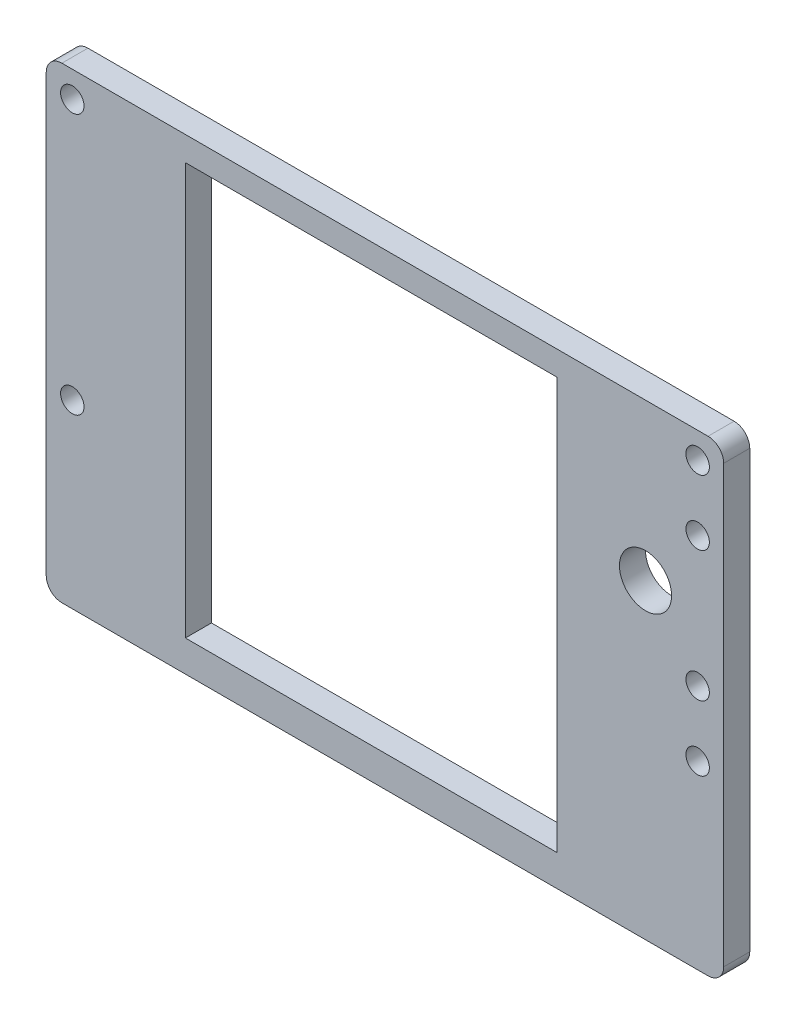
ISO-10303-21;
HEADER;
FILE_DESCRIPTION(('STEP AP214'),'2;1');
FILE_NAME('part.step','',(''),(''),'','','');
FILE_SCHEMA(('AUTOMOTIVE_DESIGN { 1 0 10303 214 1 1 1 1 }'));
ENDSEC;
DATA;
#1=APPLICATION_CONTEXT('core data for automotive mechanical design processes');
#2=APPLICATION_PROTOCOL_DEFINITION('international standard','automotive_design',2000,#1);
#3=PRODUCT_CONTEXT('',#1,'mechanical');
#4=PRODUCT('Part','Part','',(#3));
#5=PRODUCT_RELATED_PRODUCT_CATEGORY('part','',(#4));
#6=PRODUCT_DEFINITION_FORMATION('','',#4);
#7=PRODUCT_DEFINITION_CONTEXT('part definition',#1,'design');
#8=PRODUCT_DEFINITION('design','',#6,#7);
#9=PRODUCT_DEFINITION_SHAPE('','',#8);
#10=(LENGTH_UNIT() NAMED_UNIT(*) SI_UNIT(.MILLI.,.METRE.));
#11=(NAMED_UNIT(*) PLANE_ANGLE_UNIT() SI_UNIT($,.RADIAN.));
#12=(NAMED_UNIT(*) SI_UNIT($,.STERADIAN.) SOLID_ANGLE_UNIT());
#13=UNCERTAINTY_MEASURE_WITH_UNIT(LENGTH_MEASURE(1.E-05),#10,'distance_accuracy_value','');
#14=(GEOMETRIC_REPRESENTATION_CONTEXT(3) GLOBAL_UNCERTAINTY_ASSIGNED_CONTEXT((#13)) GLOBAL_UNIT_ASSIGNED_CONTEXT((#10,
#11,#12)) REPRESENTATION_CONTEXT('',''));
#15=CARTESIAN_POINT('',(0.,0.,0.));
#16=DIRECTION('',(0.,0.,1.));
#17=DIRECTION('',(1.,0.,0.));
#18=AXIS2_PLACEMENT_3D('',#15,#16,#17);
#19=CARTESIAN_POINT('',(0.,0.,5.));
#20=DIRECTION('',(0.,0.,1.));
#21=DIRECTION('',(1.,0.,0.));
#22=AXIS2_PLACEMENT_3D('',#19,#20,#21);
#23=PLANE('',#22);
#24=CARTESIAN_POINT('',(125.,-17.5,5.));
#25=DIRECTION('',(0.,0.,1.));
#26=DIRECTION('',(1.,0.,0.));
#27=AXIS2_PLACEMENT_3D('',#24,#25,#26);
#28=CIRCLE('',#27,2.25000000000001);
#29=CARTESIAN_POINT('',(127.25,-17.5,5.));
#30=VERTEX_POINT('',#29);
#31=EDGE_CURVE('E497',#30,#30,#28,.T.);
#32=ORIENTED_EDGE('',*,*,#31,.F.);
#33=EDGE_LOOP('',(#32));
#34=FACE_BOUND('',#33,.T.);
#35=CARTESIAN_POINT('',(125.,-42.5,5.));
#36=DIRECTION('',(0.,0.,1.));
#37=DIRECTION('',(1.,0.,0.));
#38=AXIS2_PLACEMENT_3D('',#35,#36,#37);
#39=CIRCLE('',#38,2.24999999999998);
#40=CARTESIAN_POINT('',(127.25,-42.5,5.));
#41=VERTEX_POINT('',#40);
#42=EDGE_CURVE('E491',#41,#41,#39,.T.);
#43=ORIENTED_EDGE('',*,*,#42,.F.);
#44=EDGE_LOOP('',(#43));
#45=FACE_BOUND('',#44,.T.);
#46=CARTESIAN_POINT('',(115.,-30.,5.));
#47=DIRECTION('',(0.,0.,-1.));
#48=DIRECTION('',(-1.,0.,0.));
#49=AXIS2_PLACEMENT_3D('',#46,#47,#48);
#50=CIRCLE('',#49,4.99999999999999);
#51=CARTESIAN_POINT('',(110.,-30.,5.));
#52=VERTEX_POINT('',#51);
#53=EDGE_CURVE('E452',#52,#52,#50,.T.);
#54=ORIENTED_EDGE('',*,*,#53,.T.);
#55=EDGE_LOOP('',(#54));
#56=FACE_BOUND('',#55,.T.);
#57=CARTESIAN_POINT('',(5.00000000000002,-55.,5.));
#58=DIRECTION('',(0.,0.,1.));
#59=DIRECTION('',(1.,0.,0.));
#60=AXIS2_PLACEMENT_3D('',#57,#58,#59);
#61=CIRCLE('',#60,2.25);
#62=CARTESIAN_POINT('',(7.25000000000003,-55.,5.));
#63=VERTEX_POINT('',#62);
#64=EDGE_CURVE('E462',#63,#63,#61,.T.);
#65=ORIENTED_EDGE('',*,*,#64,.F.);
#66=EDGE_LOOP('',(#65));
#67=FACE_BOUND('',#66,.T.);
#68=CARTESIAN_POINT('',(125.,-4.99999999999997,5.));
#69=DIRECTION('',(0.,0.,1.));
#70=DIRECTION('',(1.,0.,0.));
#71=AXIS2_PLACEMENT_3D('',#68,#69,#70);
#72=CIRCLE('',#71,2.25000000000001);
#73=CARTESIAN_POINT('',(127.25,-4.99999999999997,5.));
#74=VERTEX_POINT('',#73);
#75=EDGE_CURVE('E156',#74,#74,#72,.T.);
#76=ORIENTED_EDGE('',*,*,#75,.F.);
#77=EDGE_LOOP('',(#76));
#78=FACE_BOUND('',#77,.T.);
#79=DIRECTION('',(0.,1.,0.));
#80=VECTOR('',#79,1.);
#81=CARTESIAN_POINT('',(130.,0.,5.));
#82=LINE('',#81,#80);
#83=CARTESIAN_POINT('',(130.,-86.6793782494457,5.));
#84=VERTEX_POINT('',#83);
#85=CARTESIAN_POINT('',(130.,-3.,5.));
#86=VERTEX_POINT('',#85);
#87=EDGE_CURVE('E172',#84,#86,#82,.T.);
#88=ORIENTED_EDGE('',*,*,#87,.T.);
#89=CARTESIAN_POINT('',(127.,-3.,5.));
#90=DIRECTION('',(0.,0.,1.));
#91=DIRECTION('',(1.,0.,0.));
#92=AXIS2_PLACEMENT_3D('',#89,#90,#91);
#93=CIRCLE('',#92,3.);
#94=CARTESIAN_POINT('',(127.,0.,5.));
#95=VERTEX_POINT('',#94);
#96=EDGE_CURVE('E210',#86,#95,#93,.T.);
#97=ORIENTED_EDGE('',*,*,#96,.T.);
#98=DIRECTION('',(-1.,0.,0.));
#99=VECTOR('',#98,1.);
#100=CARTESIAN_POINT('',(0.,0.,5.));
#101=LINE('',#100,#99);
#102=CARTESIAN_POINT('',(3.,0.,5.));
#103=VERTEX_POINT('',#102);
#104=EDGE_CURVE('E175',#95,#103,#101,.T.);
#105=ORIENTED_EDGE('',*,*,#104,.T.);
#106=CARTESIAN_POINT('',(3.,-3.,5.));
#107=DIRECTION('',(0.,0.,1.));
#108=DIRECTION('',(1.,0.,0.));
#109=AXIS2_PLACEMENT_3D('',#106,#107,#108);
#110=CIRCLE('',#109,3.);
#111=CARTESIAN_POINT('',(0.,-3.,5.));
#112=VERTEX_POINT('',#111);
#113=EDGE_CURVE('E205',#103,#112,#110,.T.);
#114=ORIENTED_EDGE('',*,*,#113,.T.);
#115=DIRECTION('',(0.,-1.,0.));
#116=VECTOR('',#115,1.);
#117=CARTESIAN_POINT('',(0.,0.,5.));
#118=LINE('',#117,#116);
#119=CARTESIAN_POINT('',(0.,-86.6793782494457,5.));
#120=VERTEX_POINT('',#119);
#121=EDGE_CURVE('E167',#112,#120,#118,.T.);
#122=ORIENTED_EDGE('',*,*,#121,.T.);
#123=CARTESIAN_POINT('',(3.,-86.6793782494457,5.));
#124=DIRECTION('',(0.,0.,1.));
#125=DIRECTION('',(1.,0.,0.));
#126=AXIS2_PLACEMENT_3D('',#123,#124,#125);
#127=CIRCLE('',#126,3.);
#128=CARTESIAN_POINT('',(3.,-89.6793782494457,5.));
#129=VERTEX_POINT('',#128);
#130=EDGE_CURVE('E54',#120,#129,#127,.T.);
#131=ORIENTED_EDGE('',*,*,#130,.T.);
#132=DIRECTION('',(1.,0.,0.));
#133=VECTOR('',#132,1.);
#134=CARTESIAN_POINT('',(0.,-89.6793782494457,5.));
#135=LINE('',#134,#133);
#136=CARTESIAN_POINT('',(127.,-89.6793782494457,5.));
#137=VERTEX_POINT('',#136);
#138=EDGE_CURVE('E169',#129,#137,#135,.T.);
#139=ORIENTED_EDGE('',*,*,#138,.T.);
#140=CARTESIAN_POINT('',(127.,-86.6793782494457,5.));
#141=DIRECTION('',(0.,0.,1.));
#142=DIRECTION('',(1.,0.,0.));
#143=AXIS2_PLACEMENT_3D('',#140,#141,#142);
#144=CIRCLE('',#143,3.);
#145=EDGE_CURVE('E208',#137,#84,#144,.T.);
#146=ORIENTED_EDGE('',*,*,#145,.T.);
#147=EDGE_LOOP('',(#88,#97,#105,#114,#122,#131,#139,#146));
#148=FACE_BOUND('',#147,.T.);
#149=DIRECTION('',(1.,0.,0.));
#150=VECTOR('',#149,1.);
#151=CARTESIAN_POINT('',(97.9999999999957,-83.6793782494454,5.));
#152=LINE('',#151,#150);
#153=CARTESIAN_POINT('',(26.6999999999957,-83.6793782494454,5.));
#154=VERTEX_POINT('',#153);
#155=CARTESIAN_POINT('',(97.9999999999957,-83.6793782494454,5.));
#156=VERTEX_POINT('',#155);
#157=EDGE_CURVE('E133',#154,#156,#152,.T.);
#158=ORIENTED_EDGE('',*,*,#157,.F.);
#159=DIRECTION('',(0.,-1.,0.));
#160=VECTOR('',#159,1.);
#161=CARTESIAN_POINT('',(26.6999999999957,-83.6793782494454,5.));
#162=LINE('',#161,#160);
#163=CARTESIAN_POINT('',(26.6999999999957,-4.67937824944543,5.));
#164=VERTEX_POINT('',#163);
#165=EDGE_CURVE('E123',#164,#154,#162,.T.);
#166=ORIENTED_EDGE('',*,*,#165,.F.);
#167=DIRECTION('',(-1.,0.,0.));
#168=VECTOR('',#167,1.);
#169=CARTESIAN_POINT('',(26.6999999999957,-4.67937824944543,5.));
#170=LINE('',#169,#168);
#171=CARTESIAN_POINT('',(97.9999999999957,-4.67937824944543,5.));
#172=VERTEX_POINT('',#171);
#173=EDGE_CURVE('E149',#172,#164,#170,.T.);
#174=ORIENTED_EDGE('',*,*,#173,.F.);
#175=DIRECTION('',(0.,1.,0.));
#176=VECTOR('',#175,1.);
#177=CARTESIAN_POINT('',(97.9999999999957,-83.6793782494454,5.));
#178=LINE('',#177,#176);
#179=EDGE_CURVE('E147',#156,#172,#178,.T.);
#180=ORIENTED_EDGE('',*,*,#179,.F.);
#181=EDGE_LOOP('',(#158,#166,#174,#180));
#182=FACE_BOUND('',#181,.T.);
#183=CARTESIAN_POINT('',(125.,-55.,5.));
#184=DIRECTION('',(0.,0.,1.));
#185=DIRECTION('',(1.,0.,0.));
#186=AXIS2_PLACEMENT_3D('',#183,#184,#185);
#187=CIRCLE('',#186,2.25000000000001);
#188=CARTESIAN_POINT('',(127.25,-55.,5.));
#189=VERTEX_POINT('',#188);
#190=EDGE_CURVE('E467',#189,#189,#187,.T.);
#191=ORIENTED_EDGE('',*,*,#190,.F.);
#192=EDGE_LOOP('',(#191));
#193=FACE_BOUND('',#192,.T.);
#194=CARTESIAN_POINT('',(5.,-5.,5.));
#195=DIRECTION('',(0.,0.,1.));
#196=DIRECTION('',(1.,0.,0.));
#197=AXIS2_PLACEMENT_3D('',#194,#195,#196);
#198=CIRCLE('',#197,2.25);
#199=CARTESIAN_POINT('',(7.25,-5.,5.));
#200=VERTEX_POINT('',#199);
#201=EDGE_CURVE('E451',#200,#200,#198,.T.);
#202=ORIENTED_EDGE('',*,*,#201,.F.);
#203=EDGE_LOOP('',(#202));
#204=FACE_BOUND('',#203,.T.);
#205=ADVANCED_FACE('F32',(#34,#45,#56,#67,#78,#148,#182,#193,#204),#23,.T.);
#206=CARTESIAN_POINT('',(0.,0.,0.));
#207=DIRECTION('',(0.,0.,1.));
#208=DIRECTION('',(1.,0.,0.));
#209=AXIS2_PLACEMENT_3D('',#206,#207,#208);
#210=PLANE('',#209);
#211=CARTESIAN_POINT('',(125.,-17.5,0.));
#212=DIRECTION('',(0.,0.,1.));
#213=DIRECTION('',(1.,0.,0.));
#214=AXIS2_PLACEMENT_3D('',#211,#212,#213);
#215=CIRCLE('',#214,2.25000000000001);
#216=CARTESIAN_POINT('',(127.25,-17.5,0.));
#217=VERTEX_POINT('',#216);
#218=EDGE_CURVE('E494',#217,#217,#215,.T.);
#219=ORIENTED_EDGE('',*,*,#218,.T.);
#220=EDGE_LOOP('',(#219));
#221=FACE_BOUND('',#220,.T.);
#222=CARTESIAN_POINT('',(125.,-42.5,0.));
#223=DIRECTION('',(0.,0.,1.));
#224=DIRECTION('',(1.,0.,0.));
#225=AXIS2_PLACEMENT_3D('',#222,#223,#224);
#226=CIRCLE('',#225,2.24999999999998);
#227=CARTESIAN_POINT('',(127.25,-42.5,0.));
#228=VERTEX_POINT('',#227);
#229=EDGE_CURVE('E489',#228,#228,#226,.T.);
#230=ORIENTED_EDGE('',*,*,#229,.T.);
#231=EDGE_LOOP('',(#230));
#232=FACE_BOUND('',#231,.T.);
#233=CARTESIAN_POINT('',(115.,-30.,0.));
#234=DIRECTION('',(0.,0.,-1.));
#235=DIRECTION('',(-1.,0.,0.));
#236=AXIS2_PLACEMENT_3D('',#233,#234,#235);
#237=CIRCLE('',#236,4.99999999999999);
#238=CARTESIAN_POINT('',(110.,-30.,0.));
#239=VERTEX_POINT('',#238);
#240=EDGE_CURVE('E458',#239,#239,#237,.T.);
#241=ORIENTED_EDGE('',*,*,#240,.F.);
#242=EDGE_LOOP('',(#241));
#243=FACE_BOUND('',#242,.T.);
#244=CARTESIAN_POINT('',(5.00000000000002,-55.,0.));
#245=DIRECTION('',(0.,0.,1.));
#246=DIRECTION('',(1.,0.,0.));
#247=AXIS2_PLACEMENT_3D('',#244,#245,#246);
#248=CIRCLE('',#247,2.25);
#249=CARTESIAN_POINT('',(7.25000000000003,-55.,0.));
#250=VERTEX_POINT('',#249);
#251=EDGE_CURVE('E455',#250,#250,#248,.T.);
#252=ORIENTED_EDGE('',*,*,#251,.T.);
#253=EDGE_LOOP('',(#252));
#254=FACE_BOUND('',#253,.T.);
#255=CARTESIAN_POINT('',(125.,-4.99999999999997,0.));
#256=DIRECTION('',(0.,0.,1.));
#257=DIRECTION('',(1.,0.,0.));
#258=AXIS2_PLACEMENT_3D('',#255,#256,#257);
#259=CIRCLE('',#258,2.25000000000001);
#260=CARTESIAN_POINT('',(127.25,-4.99999999999997,0.));
#261=VERTEX_POINT('',#260);
#262=EDGE_CURVE('E470',#261,#261,#259,.T.);
#263=ORIENTED_EDGE('',*,*,#262,.T.);
#264=EDGE_LOOP('',(#263));
#265=FACE_BOUND('',#264,.T.);
#266=DIRECTION('',(-1.,0.,0.));
#267=VECTOR('',#266,1.);
#268=CARTESIAN_POINT('',(0.,0.,0.));
#269=LINE('',#268,#267);
#270=CARTESIAN_POINT('',(127.,0.,0.));
#271=VERTEX_POINT('',#270);
#272=CARTESIAN_POINT('',(3.,0.,0.));
#273=VERTEX_POINT('',#272);
#274=EDGE_CURVE('E170',#271,#273,#269,.T.);
#275=ORIENTED_EDGE('',*,*,#274,.F.);
#276=CARTESIAN_POINT('',(127.,-3.,0.));
#277=DIRECTION('',(0.,0.,1.));
#278=DIRECTION('',(1.,0.,0.));
#279=AXIS2_PLACEMENT_3D('',#276,#277,#278);
#280=CIRCLE('',#279,3.);
#281=CARTESIAN_POINT('',(130.,-3.,0.));
#282=VERTEX_POINT('',#281);
#283=EDGE_CURVE('E198',#271,#282,#280,.F.);
#284=ORIENTED_EDGE('',*,*,#283,.T.);
#285=DIRECTION('',(0.,1.,0.));
#286=VECTOR('',#285,1.);
#287=CARTESIAN_POINT('',(130.,0.,0.));
#288=LINE('',#287,#286);
#289=CARTESIAN_POINT('',(130.,-86.6793782494457,0.));
#290=VERTEX_POINT('',#289);
#291=EDGE_CURVE('E183',#290,#282,#288,.T.);
#292=ORIENTED_EDGE('',*,*,#291,.F.);
#293=CARTESIAN_POINT('',(127.,-86.6793782494457,0.));
#294=DIRECTION('',(0.,0.,1.));
#295=DIRECTION('',(1.,0.,0.));
#296=AXIS2_PLACEMENT_3D('',#293,#294,#295);
#297=CIRCLE('',#296,3.);
#298=CARTESIAN_POINT('',(127.,-89.6793782494457,0.));
#299=VERTEX_POINT('',#298);
#300=EDGE_CURVE('E196',#290,#299,#297,.F.);
#301=ORIENTED_EDGE('',*,*,#300,.T.);
#302=DIRECTION('',(1.,0.,0.));
#303=VECTOR('',#302,1.);
#304=CARTESIAN_POINT('',(0.,-89.6793782494457,0.));
#305=LINE('',#304,#303);
#306=CARTESIAN_POINT('',(3.,-89.6793782494457,0.));
#307=VERTEX_POINT('',#306);
#308=EDGE_CURVE('E181',#307,#299,#305,.T.);
#309=ORIENTED_EDGE('',*,*,#308,.F.);
#310=CARTESIAN_POINT('',(3.,-86.6793782494457,0.));
#311=DIRECTION('',(0.,0.,1.));
#312=DIRECTION('',(1.,0.,0.));
#313=AXIS2_PLACEMENT_3D('',#310,#311,#312);
#314=CIRCLE('',#313,3.);
#315=CARTESIAN_POINT('',(0.,-86.6793782494457,0.));
#316=VERTEX_POINT('',#315);
#317=EDGE_CURVE('E194',#307,#316,#314,.F.);
#318=ORIENTED_EDGE('',*,*,#317,.T.);
#319=DIRECTION('',(0.,-1.,0.));
#320=VECTOR('',#319,1.);
#321=CARTESIAN_POINT('',(0.,0.,0.));
#322=LINE('',#321,#320);
#323=CARTESIAN_POINT('',(0.,-3.,0.));
#324=VERTEX_POINT('',#323);
#325=EDGE_CURVE('E141',#324,#316,#322,.T.);
#326=ORIENTED_EDGE('',*,*,#325,.F.);
#327=CARTESIAN_POINT('',(3.,-3.,0.));
#328=DIRECTION('',(0.,0.,1.));
#329=DIRECTION('',(1.,0.,0.));
#330=AXIS2_PLACEMENT_3D('',#327,#328,#329);
#331=CIRCLE('',#330,3.);
#332=EDGE_CURVE('E192',#324,#273,#331,.F.);
#333=ORIENTED_EDGE('',*,*,#332,.T.);
#334=EDGE_LOOP('',(#275,#284,#292,#301,#309,#318,#326,#333));
#335=FACE_BOUND('',#334,.T.);
#336=DIRECTION('',(0.,-1.,0.));
#337=VECTOR('',#336,1.);
#338=CARTESIAN_POINT('',(26.6999999999957,-83.6793782494454,0.));
#339=LINE('',#338,#337);
#340=CARTESIAN_POINT('',(26.6999999999957,-4.67937824944543,0.));
#341=VERTEX_POINT('',#340);
#342=CARTESIAN_POINT('',(26.6999999999957,-83.6793782494454,0.));
#343=VERTEX_POINT('',#342);
#344=EDGE_CURVE('E154',#341,#343,#339,.T.);
#345=ORIENTED_EDGE('',*,*,#344,.T.);
#346=DIRECTION('',(1.,0.,0.));
#347=VECTOR('',#346,1.);
#348=CARTESIAN_POINT('',(97.9999999999957,-83.6793782494454,0.));
#349=LINE('',#348,#347);
#350=CARTESIAN_POINT('',(97.9999999999957,-83.6793782494454,0.));
#351=VERTEX_POINT('',#350);
#352=EDGE_CURVE('E140',#343,#351,#349,.T.);
#353=ORIENTED_EDGE('',*,*,#352,.T.);
#354=DIRECTION('',(0.,1.,0.));
#355=VECTOR('',#354,1.);
#356=CARTESIAN_POINT('',(97.9999999999957,-83.6793782494454,0.));
#357=LINE('',#356,#355);
#358=CARTESIAN_POINT('',(97.9999999999957,-4.67937824944543,0.));
#359=VERTEX_POINT('',#358);
#360=EDGE_CURVE('E158',#351,#359,#357,.T.);
#361=ORIENTED_EDGE('',*,*,#360,.T.);
#362=DIRECTION('',(-1.,0.,0.));
#363=VECTOR('',#362,1.);
#364=CARTESIAN_POINT('',(26.6999999999957,-4.67937824944543,0.));
#365=LINE('',#364,#363);
#366=EDGE_CURVE('E134',#359,#341,#365,.T.);
#367=ORIENTED_EDGE('',*,*,#366,.T.);
#368=EDGE_LOOP('',(#345,#353,#361,#367));
#369=FACE_BOUND('',#368,.T.);
#370=CARTESIAN_POINT('',(125.,-55.,0.));
#371=DIRECTION('',(0.,0.,1.));
#372=DIRECTION('',(1.,0.,0.));
#373=AXIS2_PLACEMENT_3D('',#370,#371,#372);
#374=CIRCLE('',#373,2.25000000000001);
#375=CARTESIAN_POINT('',(127.25,-55.,0.));
#376=VERTEX_POINT('',#375);
#377=EDGE_CURVE('E446',#376,#376,#374,.T.);
#378=ORIENTED_EDGE('',*,*,#377,.T.);
#379=EDGE_LOOP('',(#378));
#380=FACE_BOUND('',#379,.T.);
#381=CARTESIAN_POINT('',(5.,-5.,0.));
#382=DIRECTION('',(0.,0.,1.));
#383=DIRECTION('',(1.,0.,0.));
#384=AXIS2_PLACEMENT_3D('',#381,#382,#383);
#385=CIRCLE('',#384,2.25);
#386=CARTESIAN_POINT('',(7.25,-5.,0.));
#387=VERTEX_POINT('',#386);
#388=EDGE_CURVE('E449',#387,#387,#385,.T.);
#389=ORIENTED_EDGE('',*,*,#388,.T.);
#390=EDGE_LOOP('',(#389));
#391=FACE_BOUND('',#390,.T.);
#392=ADVANCED_FACE('F226',(#221,#232,#243,#254,#265,#335,#369,#380,#391),#210,.F.);
#393=CARTESIAN_POINT('',(0.,0.,5.));
#394=DIRECTION('',(1.,0.,0.));
#395=DIRECTION('',(0.,0.,-1.));
#396=AXIS2_PLACEMENT_3D('',#393,#394,#395);
#397=PLANE('',#396);
#398=ORIENTED_EDGE('',*,*,#325,.T.);
#399=DIRECTION('',(0.,0.,-1.));
#400=VECTOR('',#399,1.);
#401=CARTESIAN_POINT('',(0.,-86.6793782494457,5.));
#402=LINE('',#401,#400);
#403=EDGE_CURVE('E11',#316,#120,#402,.F.);
#404=ORIENTED_EDGE('',*,*,#403,.T.);
#405=ORIENTED_EDGE('',*,*,#121,.F.);
#406=DIRECTION('',(0.,0.,-1.));
#407=VECTOR('',#406,1.);
#408=CARTESIAN_POINT('',(0.,-3.,5.));
#409=LINE('',#408,#407);
#410=EDGE_CURVE('E40',#112,#324,#409,.T.);
#411=ORIENTED_EDGE('',*,*,#410,.T.);
#412=EDGE_LOOP('',(#398,#404,#405,#411));
#413=FACE_BOUND('',#412,.T.);
#414=ADVANCED_FACE('F220',(#413),#397,.F.);
#415=CARTESIAN_POINT('',(0.,-89.6793782494457,5.));
#416=DIRECTION('',(0.,1.,0.));
#417=DIRECTION('',(0.,0.,1.));
#418=AXIS2_PLACEMENT_3D('',#415,#416,#417);
#419=PLANE('',#418);
#420=ORIENTED_EDGE('',*,*,#308,.T.);
#421=DIRECTION('',(0.,0.,-1.));
#422=VECTOR('',#421,1.);
#423=CARTESIAN_POINT('',(127.,-89.6793782494457,5.));
#424=LINE('',#423,#422);
#425=EDGE_CURVE('E47',#299,#137,#424,.F.);
#426=ORIENTED_EDGE('',*,*,#425,.T.);
#427=ORIENTED_EDGE('',*,*,#138,.F.);
#428=DIRECTION('',(0.,0.,-1.));
#429=VECTOR('',#428,1.);
#430=CARTESIAN_POINT('',(3.,-89.6793782494457,5.));
#431=LINE('',#430,#429);
#432=EDGE_CURVE('E212',#129,#307,#431,.T.);
#433=ORIENTED_EDGE('',*,*,#432,.T.);
#434=EDGE_LOOP('',(#420,#426,#427,#433));
#435=FACE_BOUND('',#434,.T.);
#436=ADVANCED_FACE('F232',(#435),#419,.F.);
#437=CARTESIAN_POINT('',(130.,0.,5.));
#438=DIRECTION('',(-1.,0.,0.));
#439=DIRECTION('',(0.,0.,1.));
#440=AXIS2_PLACEMENT_3D('',#437,#438,#439);
#441=PLANE('',#440);
#442=ORIENTED_EDGE('',*,*,#291,.T.);
#443=DIRECTION('',(0.,0.,-1.));
#444=VECTOR('',#443,1.);
#445=CARTESIAN_POINT('',(130.,-3.,5.));
#446=LINE('',#445,#444);
#447=EDGE_CURVE('E203',#282,#86,#446,.F.);
#448=ORIENTED_EDGE('',*,*,#447,.T.);
#449=ORIENTED_EDGE('',*,*,#87,.F.);
#450=DIRECTION('',(0.,0.,-1.));
#451=VECTOR('',#450,1.);
#452=CARTESIAN_POINT('',(130.,-86.6793782494457,5.));
#453=LINE('',#452,#451);
#454=EDGE_CURVE('E200',#84,#290,#453,.T.);
#455=ORIENTED_EDGE('',*,*,#454,.T.);
#456=EDGE_LOOP('',(#442,#448,#449,#455));
#457=FACE_BOUND('',#456,.T.);
#458=ADVANCED_FACE('F240',(#457),#441,.F.);
#459=CARTESIAN_POINT('',(0.,0.,5.));
#460=DIRECTION('',(0.,-1.,0.));
#461=DIRECTION('',(0.,0.,-1.));
#462=AXIS2_PLACEMENT_3D('',#459,#460,#461);
#463=PLANE('',#462);
#464=ORIENTED_EDGE('',*,*,#104,.F.);
#465=DIRECTION('',(0.,0.,-1.));
#466=VECTOR('',#465,1.);
#467=CARTESIAN_POINT('',(127.,0.,5.));
#468=LINE('',#467,#466);
#469=EDGE_CURVE('E189',#95,#271,#468,.T.);
#470=ORIENTED_EDGE('',*,*,#469,.T.);
#471=ORIENTED_EDGE('',*,*,#274,.T.);
#472=DIRECTION('',(0.,0.,-1.));
#473=VECTOR('',#472,1.);
#474=CARTESIAN_POINT('',(3.,0.,5.));
#475=LINE('',#474,#473);
#476=EDGE_CURVE('E178',#273,#103,#475,.F.);
#477=ORIENTED_EDGE('',*,*,#476,.T.);
#478=EDGE_LOOP('',(#464,#470,#471,#477));
#479=FACE_BOUND('',#478,.T.);
#480=ADVANCED_FACE('F248',(#479),#463,.F.);
#481=CARTESIAN_POINT('',(26.6999999999957,-83.6793782494454,5.));
#482=DIRECTION('',(1.,0.,0.));
#483=DIRECTION('',(0.,1.,0.));
#484=AXIS2_PLACEMENT_3D('',#481,#482,#483);
#485=PLANE('',#484);
#486=ORIENTED_EDGE('',*,*,#344,.F.);
#487=DIRECTION('',(0.,0.,-1.));
#488=VECTOR('',#487,1.);
#489=CARTESIAN_POINT('',(26.6999999999957,-4.67937824944543,5.));
#490=LINE('',#489,#488);
#491=EDGE_CURVE('E129',#164,#341,#490,.T.);
#492=ORIENTED_EDGE('',*,*,#491,.F.);
#493=ORIENTED_EDGE('',*,*,#165,.T.);
#494=DIRECTION('',(0.,0.,-1.));
#495=VECTOR('',#494,1.);
#496=CARTESIAN_POINT('',(26.6999999999957,-83.6793782494454,5.));
#497=LINE('',#496,#495);
#498=EDGE_CURVE('E126',#154,#343,#497,.T.);
#499=ORIENTED_EDGE('',*,*,#498,.T.);
#500=EDGE_LOOP('',(#486,#492,#493,#499));
#501=FACE_BOUND('',#500,.T.);
#502=ADVANCED_FACE('F125',(#501),#485,.T.);
#503=CARTESIAN_POINT('',(97.9999999999957,-83.6793782494454,5.));
#504=DIRECTION('',(0.,1.,0.));
#505=DIRECTION('',(0.,0.,1.));
#506=AXIS2_PLACEMENT_3D('',#503,#504,#505);
#507=PLANE('',#506);
#508=ORIENTED_EDGE('',*,*,#352,.F.);
#509=ORIENTED_EDGE('',*,*,#498,.F.);
#510=ORIENTED_EDGE('',*,*,#157,.T.);
#511=DIRECTION('',(0.,0.,-1.));
#512=VECTOR('',#511,1.);
#513=CARTESIAN_POINT('',(97.9999999999957,-83.6793782494454,5.));
#514=LINE('',#513,#512);
#515=EDGE_CURVE('E142',#156,#351,#514,.T.);
#516=ORIENTED_EDGE('',*,*,#515,.T.);
#517=EDGE_LOOP('',(#508,#509,#510,#516));
#518=FACE_BOUND('',#517,.T.);
#519=ADVANCED_FACE('F137',(#518),#507,.T.);
#520=CARTESIAN_POINT('',(97.9999999999957,-83.6793782494454,5.));
#521=DIRECTION('',(-1.,0.,0.));
#522=DIRECTION('',(0.,0.,1.));
#523=AXIS2_PLACEMENT_3D('',#520,#521,#522);
#524=PLANE('',#523);
#525=ORIENTED_EDGE('',*,*,#360,.F.);
#526=ORIENTED_EDGE('',*,*,#515,.F.);
#527=ORIENTED_EDGE('',*,*,#179,.T.);
#528=DIRECTION('',(0.,0.,-1.));
#529=VECTOR('',#528,1.);
#530=CARTESIAN_POINT('',(97.9999999999957,-4.67937824944543,5.));
#531=LINE('',#530,#529);
#532=EDGE_CURVE('E164',#172,#359,#531,.T.);
#533=ORIENTED_EDGE('',*,*,#532,.T.);
#534=EDGE_LOOP('',(#525,#526,#527,#533));
#535=FACE_BOUND('',#534,.T.);
#536=ADVANCED_FACE('F357',(#535),#524,.T.);
#537=CARTESIAN_POINT('',(26.6999999999957,-4.67937824944543,5.));
#538=DIRECTION('',(0.,-1.,0.));
#539=DIRECTION('',(0.,0.,-1.));
#540=AXIS2_PLACEMENT_3D('',#537,#538,#539);
#541=PLANE('',#540);
#542=ORIENTED_EDGE('',*,*,#366,.F.);
#543=ORIENTED_EDGE('',*,*,#532,.F.);
#544=ORIENTED_EDGE('',*,*,#173,.T.);
#545=ORIENTED_EDGE('',*,*,#491,.T.);
#546=EDGE_LOOP('',(#542,#543,#544,#545));
#547=FACE_BOUND('',#546,.T.);
#548=ADVANCED_FACE('F353',(#547),#541,.T.);
#549=CARTESIAN_POINT('',(125.,-4.99999999999997,5.));
#550=DIRECTION('',(0.,0.,-1.));
#551=DIRECTION('',(-1.,0.,0.));
#552=AXIS2_PLACEMENT_3D('',#549,#550,#551);
#553=CYLINDRICAL_SURFACE('',#552,2.25000000000001);
#554=ORIENTED_EDGE('',*,*,#75,.T.);
#555=EDGE_LOOP('',(#554));
#556=FACE_BOUND('',#555,.T.);
#557=ORIENTED_EDGE('',*,*,#262,.F.);
#558=EDGE_LOOP('',(#557));
#559=FACE_BOUND('',#558,.T.);
#560=ADVANCED_FACE('F349',(#556,#559),#553,.F.);
#561=CARTESIAN_POINT('',(125.,-55.,5.));
#562=DIRECTION('',(0.,0.,-1.));
#563=DIRECTION('',(-1.,0.,0.));
#564=AXIS2_PLACEMENT_3D('',#561,#562,#563);
#565=CYLINDRICAL_SURFACE('',#564,2.25000000000001);
#566=ORIENTED_EDGE('',*,*,#190,.T.);
#567=EDGE_LOOP('',(#566));
#568=FACE_BOUND('',#567,.T.);
#569=ORIENTED_EDGE('',*,*,#377,.F.);
#570=EDGE_LOOP('',(#569));
#571=FACE_BOUND('',#570,.T.);
#572=ADVANCED_FACE('F345',(#568,#571),#565,.F.);
#573=CARTESIAN_POINT('',(5.00000000000002,-55.,5.));
#574=DIRECTION('',(0.,0.,-1.));
#575=DIRECTION('',(-1.,0.,0.));
#576=AXIS2_PLACEMENT_3D('',#573,#574,#575);
#577=CYLINDRICAL_SURFACE('',#576,2.25);
#578=ORIENTED_EDGE('',*,*,#64,.T.);
#579=EDGE_LOOP('',(#578));
#580=FACE_BOUND('',#579,.T.);
#581=ORIENTED_EDGE('',*,*,#251,.F.);
#582=EDGE_LOOP('',(#581));
#583=FACE_BOUND('',#582,.T.);
#584=ADVANCED_FACE('F341',(#580,#583),#577,.F.);
#585=CARTESIAN_POINT('',(5.,-5.,5.));
#586=DIRECTION('',(0.,0.,-1.));
#587=DIRECTION('',(-1.,0.,0.));
#588=AXIS2_PLACEMENT_3D('',#585,#586,#587);
#589=CYLINDRICAL_SURFACE('',#588,2.25);
#590=ORIENTED_EDGE('',*,*,#201,.T.);
#591=EDGE_LOOP('',(#590));
#592=FACE_BOUND('',#591,.T.);
#593=ORIENTED_EDGE('',*,*,#388,.F.);
#594=EDGE_LOOP('',(#593));
#595=FACE_BOUND('',#594,.T.);
#596=ADVANCED_FACE('F282',(#592,#595),#589,.F.);
#597=CARTESIAN_POINT('',(127.,-3.,5.));
#598=DIRECTION('',(0.,0.,-1.));
#599=DIRECTION('',(-1.,0.,0.));
#600=AXIS2_PLACEMENT_3D('',#597,#598,#599);
#601=CYLINDRICAL_SURFACE('',#600,3.);
#602=ORIENTED_EDGE('',*,*,#96,.F.);
#603=ORIENTED_EDGE('',*,*,#447,.F.);
#604=ORIENTED_EDGE('',*,*,#283,.F.);
#605=ORIENTED_EDGE('',*,*,#469,.F.);
#606=EDGE_LOOP('',(#602,#603,#604,#605));
#607=FACE_BOUND('',#606,.T.);
#608=ADVANCED_FACE('F245',(#607),#601,.T.);
#609=CARTESIAN_POINT('',(127.,-86.6793782494457,5.));
#610=DIRECTION('',(0.,0.,-1.));
#611=DIRECTION('',(-1.,0.,0.));
#612=AXIS2_PLACEMENT_3D('',#609,#610,#611);
#613=CYLINDRICAL_SURFACE('',#612,3.);
#614=ORIENTED_EDGE('',*,*,#145,.F.);
#615=ORIENTED_EDGE('',*,*,#425,.F.);
#616=ORIENTED_EDGE('',*,*,#300,.F.);
#617=ORIENTED_EDGE('',*,*,#454,.F.);
#618=EDGE_LOOP('',(#614,#615,#616,#617));
#619=FACE_BOUND('',#618,.T.);
#620=ADVANCED_FACE('F237',(#619),#613,.T.);
#621=CARTESIAN_POINT('',(3.,-86.6793782494457,5.));
#622=DIRECTION('',(0.,0.,-1.));
#623=DIRECTION('',(-1.,0.,0.));
#624=AXIS2_PLACEMENT_3D('',#621,#622,#623);
#625=CYLINDRICAL_SURFACE('',#624,3.);
#626=ORIENTED_EDGE('',*,*,#130,.F.);
#627=ORIENTED_EDGE('',*,*,#403,.F.);
#628=ORIENTED_EDGE('',*,*,#317,.F.);
#629=ORIENTED_EDGE('',*,*,#432,.F.);
#630=EDGE_LOOP('',(#626,#627,#628,#629));
#631=FACE_BOUND('',#630,.T.);
#632=ADVANCED_FACE('F231',(#631),#625,.T.);
#633=CARTESIAN_POINT('',(3.,-3.,5.));
#634=DIRECTION('',(0.,0.,-1.));
#635=DIRECTION('',(-1.,0.,0.));
#636=AXIS2_PLACEMENT_3D('',#633,#634,#635);
#637=CYLINDRICAL_SURFACE('',#636,3.);
#638=ORIENTED_EDGE('',*,*,#113,.F.);
#639=ORIENTED_EDGE('',*,*,#476,.F.);
#640=ORIENTED_EDGE('',*,*,#332,.F.);
#641=ORIENTED_EDGE('',*,*,#410,.F.);
#642=EDGE_LOOP('',(#638,#639,#640,#641));
#643=FACE_BOUND('',#642,.T.);
#644=ADVANCED_FACE('F34',(#643),#637,.T.);
#645=CARTESIAN_POINT('',(115.,-30.,5.));
#646=DIRECTION('',(0.,0.,-1.));
#647=DIRECTION('',(-1.,0.,0.));
#648=AXIS2_PLACEMENT_3D('',#645,#646,#647);
#649=CYLINDRICAL_SURFACE('',#648,4.99999999999999);
#650=ORIENTED_EDGE('',*,*,#53,.F.);
#651=EDGE_LOOP('',(#650));
#652=FACE_BOUND('',#651,.T.);
#653=ORIENTED_EDGE('',*,*,#240,.T.);
#654=EDGE_LOOP('',(#653));
#655=FACE_BOUND('',#654,.T.);
#656=ADVANCED_FACE('F251',(#652,#655),#649,.F.);
#657=CARTESIAN_POINT('',(125.,-42.5,0.));
#658=DIRECTION('',(0.,0.,1.));
#659=DIRECTION('',(1.,0.,0.));
#660=AXIS2_PLACEMENT_3D('',#657,#658,#659);
#661=CYLINDRICAL_SURFACE('',#660,2.24999999999998);
#662=ORIENTED_EDGE('',*,*,#229,.F.);
#663=EDGE_LOOP('',(#662));
#664=FACE_BOUND('',#663,.T.);
#665=ORIENTED_EDGE('',*,*,#42,.T.);
#666=EDGE_LOOP('',(#665));
#667=FACE_BOUND('',#666,.T.);
#668=ADVANCED_FACE('F256',(#664,#667),#661,.F.);
#669=CARTESIAN_POINT('',(125.,-17.5,0.));
#670=DIRECTION('',(0.,0.,1.));
#671=DIRECTION('',(1.,0.,0.));
#672=AXIS2_PLACEMENT_3D('',#669,#670,#671);
#673=CYLINDRICAL_SURFACE('',#672,2.25000000000001);
#674=ORIENTED_EDGE('',*,*,#218,.F.);
#675=EDGE_LOOP('',(#674));
#676=FACE_BOUND('',#675,.T.);
#677=ORIENTED_EDGE('',*,*,#31,.T.);
#678=EDGE_LOOP('',(#677));
#679=FACE_BOUND('',#678,.T.);
#680=ADVANCED_FACE('F323',(#676,#679),#673,.F.);
#681=CLOSED_SHELL('',(#205,#392,#414,#436,#458,#480,#502,#519,#536,#548,#560,#572,#584,#596,
#608,#620,#632,#644,#656,#668,#680));
#682=MANIFOLD_SOLID_BREP('B2',#681);
#683=ADVANCED_BREP_SHAPE_REPRESENTATION('',(#18,#682),#14);
#684=SHAPE_DEFINITION_REPRESENTATION(#9,#683);
ENDSEC;
END-ISO-10303-21;
